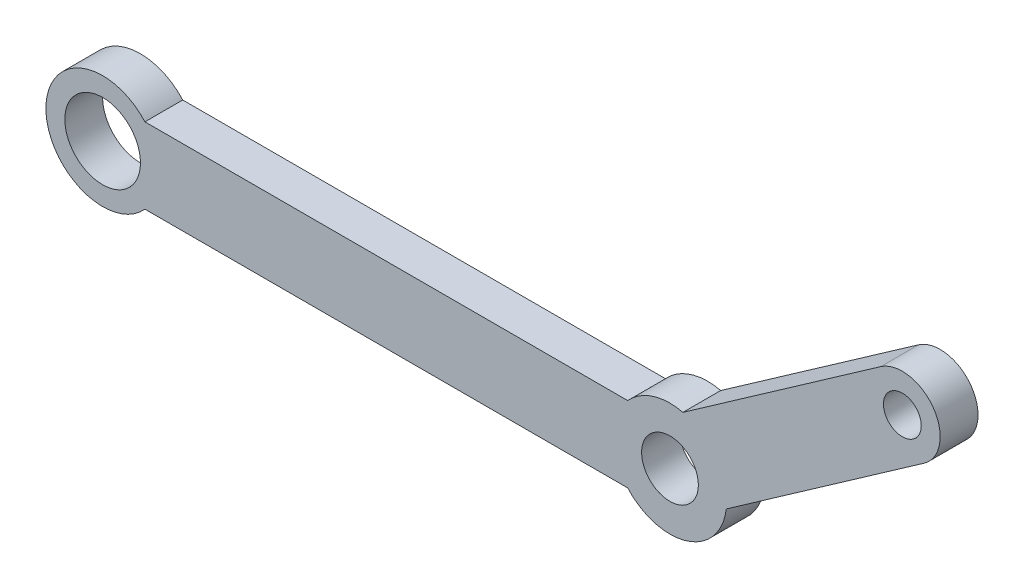
ISO-10303-21;
HEADER;
FILE_DESCRIPTION(('STEP AP214'),'2;1');
FILE_NAME('part.step','',(''),(''),'','','');
FILE_SCHEMA(('AUTOMOTIVE_DESIGN { 1 0 10303 214 1 1 1 1 }'));
ENDSEC;
DATA;
#1=APPLICATION_CONTEXT('core data for automotive mechanical design processes');
#2=APPLICATION_PROTOCOL_DEFINITION('international standard','automotive_design',2000,#1);
#3=PRODUCT_CONTEXT('',#1,'mechanical');
#4=PRODUCT('Part','Part','',(#3));
#5=PRODUCT_RELATED_PRODUCT_CATEGORY('part','',(#4));
#6=PRODUCT_DEFINITION_FORMATION('','',#4);
#7=PRODUCT_DEFINITION_CONTEXT('part definition',#1,'design');
#8=PRODUCT_DEFINITION('design','',#6,#7);
#9=PRODUCT_DEFINITION_SHAPE('','',#8);
#10=(LENGTH_UNIT() NAMED_UNIT(*) SI_UNIT(.MILLI.,.METRE.));
#11=(NAMED_UNIT(*) PLANE_ANGLE_UNIT() SI_UNIT($,.RADIAN.));
#12=(NAMED_UNIT(*) SI_UNIT($,.STERADIAN.) SOLID_ANGLE_UNIT());
#13=UNCERTAINTY_MEASURE_WITH_UNIT(LENGTH_MEASURE(1.E-05),#10,'distance_accuracy_value','');
#14=(GEOMETRIC_REPRESENTATION_CONTEXT(3) GLOBAL_UNCERTAINTY_ASSIGNED_CONTEXT((#13)) GLOBAL_UNIT_ASSIGNED_CONTEXT((#10,
#11,#12)) REPRESENTATION_CONTEXT('',''));
#15=CARTESIAN_POINT('',(0.,0.,0.));
#16=DIRECTION('',(0.,0.,1.));
#17=DIRECTION('',(1.,0.,0.));
#18=AXIS2_PLACEMENT_3D('',#15,#16,#17);
#19=CARTESIAN_POINT('',(30.,0.,2.));
#20=DIRECTION('',(0.,0.,-1.));
#21=DIRECTION('',(-1.,0.,0.));
#22=AXIS2_PLACEMENT_3D('',#19,#20,#21);
#23=CYLINDRICAL_SURFACE('',#22,3.);
#24=CARTESIAN_POINT('',(30.,0.,0.));
#25=DIRECTION('',(0.,0.,1.));
#26=DIRECTION('',(1.,0.,0.));
#27=AXIS2_PLACEMENT_3D('',#24,#25,#26);
#28=CIRCLE('',#27,3.);
#29=CARTESIAN_POINT('',(27.7639320225002,-2.,0.));
#30=VERTEX_POINT('',#29);
#31=CARTESIAN_POINT('',(32.9788325276402,-0.355748186604979,0.));
#32=VERTEX_POINT('',#31);
#33=EDGE_CURVE('E130',#30,#32,#28,.T.);
#34=ORIENTED_EDGE('',*,*,#33,.T.);
#35=DIRECTION('',(0.,0.,-1.));
#36=VECTOR('',#35,1.);
#37=CARTESIAN_POINT('',(32.9788325276402,-0.355748186604979,2.));
#38=LINE('',#37,#36);
#39=CARTESIAN_POINT('',(32.9788325276402,-0.355748186604979,2.));
#40=VERTEX_POINT('',#39);
#41=EDGE_CURVE('E11',#40,#32,#38,.T.);
#42=ORIENTED_EDGE('',*,*,#41,.F.);
#43=CARTESIAN_POINT('',(30.,0.,2.));
#44=DIRECTION('',(0.,0.,1.));
#45=DIRECTION('',(1.,0.,0.));
#46=AXIS2_PLACEMENT_3D('',#43,#44,#45);
#47=CIRCLE('',#46,3.);
#48=CARTESIAN_POINT('',(27.7639320225002,-2.,2.));
#49=VERTEX_POINT('',#48);
#50=EDGE_CURVE('E145',#49,#40,#47,.T.);
#51=ORIENTED_EDGE('',*,*,#50,.F.);
#52=DIRECTION('',(0.,0.,-1.));
#53=VECTOR('',#52,1.);
#54=CARTESIAN_POINT('',(27.7639320225002,-2.,2.));
#55=LINE('',#54,#53);
#56=EDGE_CURVE('E126',#49,#30,#55,.T.);
#57=ORIENTED_EDGE('',*,*,#56,.T.);
#58=EDGE_LOOP('',(#34,#42,#51,#57));
#59=FACE_BOUND('',#58,.T.);
#60=ADVANCED_FACE('F34',(#59),#23,.T.);
#61=CARTESIAN_POINT('',(43.434433537037,6.96534245668763,2.));
#62=DIRECTION('',(-0.573576436351042,0.819152044288995,0.));
#63=DIRECTION('',(-0.819152044288995,-0.573576436351042,0.));
#64=AXIS2_PLACEMENT_3D('',#61,#62,#63);
#65=PLANE('',#64);
#66=DIRECTION('',(0.819152044288995,0.573576436351042,0.));
#67=VECTOR('',#66,1.);
#68=CARTESIAN_POINT('',(43.434433537037,6.96534245668763,0.));
#69=LINE('',#68,#67);
#70=CARTESIAN_POINT('',(43.434433537037,6.96534245668763,0.));
#71=VERTEX_POINT('',#70);
#72=EDGE_CURVE('E133',#32,#71,#69,.T.);
#73=ORIENTED_EDGE('',*,*,#72,.T.);
#74=DIRECTION('',(0.,0.,-1.));
#75=VECTOR('',#74,1.);
#76=CARTESIAN_POINT('',(43.434433537037,6.96534245668763,2.));
#77=LINE('',#76,#75);
#78=CARTESIAN_POINT('',(43.434433537037,6.96534245668763,2.));
#79=VERTEX_POINT('',#78);
#80=EDGE_CURVE('E42',#79,#71,#77,.T.);
#81=ORIENTED_EDGE('',*,*,#80,.F.);
#82=DIRECTION('',(0.819152044288995,0.573576436351042,0.));
#83=VECTOR('',#82,1.);
#84=CARTESIAN_POINT('',(43.434433537037,6.96534245668763,2.));
#85=LINE('',#84,#83);
#86=EDGE_CURVE('E93',#40,#79,#85,.T.);
#87=ORIENTED_EDGE('',*,*,#86,.F.);
#88=ORIENTED_EDGE('',*,*,#41,.T.);
#89=EDGE_LOOP('',(#73,#81,#87,#88));
#90=FACE_BOUND('',#89,.T.);
#91=ADVANCED_FACE('F226',(#90),#65,.F.);
#92=CARTESIAN_POINT('',(42.2872806643349,8.60364654526562,2.));
#93=DIRECTION('',(0.,0.,-1.));
#94=DIRECTION('',(-1.,0.,0.));
#95=AXIS2_PLACEMENT_3D('',#92,#93,#94);
#96=CYLINDRICAL_SURFACE('',#95,2.);
#97=CARTESIAN_POINT('',(42.2872806643349,8.60364654526562,0.));
#98=DIRECTION('',(0.,0.,1.));
#99=DIRECTION('',(1.,0.,0.));
#100=AXIS2_PLACEMENT_3D('',#97,#98,#99);
#101=CIRCLE('',#100,2.);
#102=CARTESIAN_POINT('',(41.1401277916328,10.2419506338436,0.));
#103=VERTEX_POINT('',#102);
#104=EDGE_CURVE('E136',#71,#103,#101,.T.);
#105=ORIENTED_EDGE('',*,*,#104,.T.);
#106=DIRECTION('',(0.,0.,-1.));
#107=VECTOR('',#106,1.);
#108=CARTESIAN_POINT('',(41.1401277916328,10.2419506338436,2.));
#109=LINE('',#108,#107);
#110=CARTESIAN_POINT('',(41.1401277916328,10.2419506338436,2.));
#111=VERTEX_POINT('',#110);
#112=EDGE_CURVE('E152',#111,#103,#109,.T.);
#113=ORIENTED_EDGE('',*,*,#112,.F.);
#114=CARTESIAN_POINT('',(42.2872806643349,8.60364654526562,2.));
#115=DIRECTION('',(0.,0.,1.));
#116=DIRECTION('',(1.,0.,0.));
#117=AXIS2_PLACEMENT_3D('',#114,#115,#116);
#118=CIRCLE('',#117,2.);
#119=EDGE_CURVE('E160',#79,#111,#118,.T.);
#120=ORIENTED_EDGE('',*,*,#119,.F.);
#121=ORIENTED_EDGE('',*,*,#80,.T.);
#122=EDGE_LOOP('',(#105,#113,#120,#121));
#123=FACE_BOUND('',#122,.T.);
#124=ADVANCED_FACE('F158',(#123),#96,.T.);
#125=CARTESIAN_POINT('',(41.1401277916328,10.2419506338436,2.));
#126=DIRECTION('',(0.573576436351041,-0.819152044288995,0.));
#127=DIRECTION('',(0.819152044288995,0.573576436351041,0.));
#128=AXIS2_PLACEMENT_3D('',#125,#126,#127);
#129=PLANE('',#128);
#130=DIRECTION('',(-0.819152044288995,-0.573576436351041,0.));
#131=VECTOR('',#130,1.);
#132=CARTESIAN_POINT('',(41.1401277916328,10.2419506338436,0.));
#133=LINE('',#132,#131);
#134=CARTESIAN_POINT('',(30.684526782236,2.920859990551,0.));
#135=VERTEX_POINT('',#134);
#136=EDGE_CURVE('E138',#103,#135,#133,.T.);
#137=ORIENTED_EDGE('',*,*,#136,.T.);
#138=DIRECTION('',(0.,0.,-1.));
#139=VECTOR('',#138,1.);
#140=CARTESIAN_POINT('',(30.684526782236,2.920859990551,2.));
#141=LINE('',#140,#139);
#142=CARTESIAN_POINT('',(30.684526782236,2.920859990551,2.));
#143=VERTEX_POINT('',#142);
#144=EDGE_CURVE('E149',#143,#135,#141,.T.);
#145=ORIENTED_EDGE('',*,*,#144,.F.);
#146=DIRECTION('',(-0.819152044288995,-0.573576436351041,0.));
#147=VECTOR('',#146,1.);
#148=CARTESIAN_POINT('',(41.1401277916328,10.2419506338436,2.));
#149=LINE('',#148,#147);
#150=EDGE_CURVE('E172',#111,#143,#149,.T.);
#151=ORIENTED_EDGE('',*,*,#150,.F.);
#152=ORIENTED_EDGE('',*,*,#112,.T.);
#153=EDGE_LOOP('',(#137,#145,#151,#152));
#154=FACE_BOUND('',#153,.T.);
#155=ADVANCED_FACE('F168',(#154),#129,.F.);
#156=CARTESIAN_POINT('',(30.,0.,2.));
#157=DIRECTION('',(0.,0.,-1.));
#158=DIRECTION('',(-1.,0.,0.));
#159=AXIS2_PLACEMENT_3D('',#156,#157,#158);
#160=CYLINDRICAL_SURFACE('',#159,3.);
#161=CARTESIAN_POINT('',(30.,0.,0.));
#162=DIRECTION('',(0.,0.,1.));
#163=DIRECTION('',(1.,0.,0.));
#164=AXIS2_PLACEMENT_3D('',#161,#162,#163);
#165=CIRCLE('',#164,3.);
#166=CARTESIAN_POINT('',(27.7639320225002,2.,0.));
#167=VERTEX_POINT('',#166);
#168=EDGE_CURVE('E140',#135,#167,#165,.T.);
#169=ORIENTED_EDGE('',*,*,#168,.T.);
#170=DIRECTION('',(0.,0.,-1.));
#171=VECTOR('',#170,1.);
#172=CARTESIAN_POINT('',(27.7639320225002,2.,2.));
#173=LINE('',#172,#171);
#174=CARTESIAN_POINT('',(27.7639320225002,2.,2.));
#175=VERTEX_POINT('',#174);
#176=EDGE_CURVE('E121',#175,#167,#173,.T.);
#177=ORIENTED_EDGE('',*,*,#176,.F.);
#178=CARTESIAN_POINT('',(30.,0.,2.));
#179=DIRECTION('',(0.,0.,1.));
#180=DIRECTION('',(1.,0.,0.));
#181=AXIS2_PLACEMENT_3D('',#178,#179,#180);
#182=CIRCLE('',#181,3.);
#183=EDGE_CURVE('E112',#143,#175,#182,.T.);
#184=ORIENTED_EDGE('',*,*,#183,.F.);
#185=ORIENTED_EDGE('',*,*,#144,.T.);
#186=EDGE_LOOP('',(#169,#177,#184,#185));
#187=FACE_BOUND('',#186,.T.);
#188=ADVANCED_FACE('F171',(#187),#160,.T.);
#189=CARTESIAN_POINT('',(2.23606797749979,2.,2.));
#190=DIRECTION('',(0.,-1.,0.));
#191=DIRECTION('',(0.,0.,-1.));
#192=AXIS2_PLACEMENT_3D('',#189,#190,#191);
#193=PLANE('',#192);
#194=DIRECTION('',(-1.,0.,0.));
#195=VECTOR('',#194,1.);
#196=CARTESIAN_POINT('',(2.23606797749979,2.,0.));
#197=LINE('',#196,#195);
#198=CARTESIAN_POINT('',(2.23606797749979,2.,0.));
#199=VERTEX_POINT('',#198);
#200=EDGE_CURVE('E120',#167,#199,#197,.T.);
#201=ORIENTED_EDGE('',*,*,#200,.T.);
#202=DIRECTION('',(0.,0.,-1.));
#203=VECTOR('',#202,1.);
#204=CARTESIAN_POINT('',(2.23606797749979,2.,2.));
#205=LINE('',#204,#203);
#206=CARTESIAN_POINT('',(2.23606797749979,2.,2.));
#207=VERTEX_POINT('',#206);
#208=EDGE_CURVE('E117',#207,#199,#205,.T.);
#209=ORIENTED_EDGE('',*,*,#208,.F.);
#210=DIRECTION('',(-1.,0.,0.));
#211=VECTOR('',#210,1.);
#212=CARTESIAN_POINT('',(2.23606797749979,2.,2.));
#213=LINE('',#212,#211);
#214=EDGE_CURVE('E106',#175,#207,#213,.T.);
#215=ORIENTED_EDGE('',*,*,#214,.F.);
#216=ORIENTED_EDGE('',*,*,#176,.T.);
#217=EDGE_LOOP('',(#201,#209,#215,#216));
#218=FACE_BOUND('',#217,.T.);
#219=ADVANCED_FACE('F118',(#218),#193,.F.);
#220=CARTESIAN_POINT('',(0.,0.,2.));
#221=DIRECTION('',(0.,0.,-1.));
#222=DIRECTION('',(-1.,0.,0.));
#223=AXIS2_PLACEMENT_3D('',#220,#221,#222);
#224=CYLINDRICAL_SURFACE('',#223,3.);
#225=CARTESIAN_POINT('',(0.,0.,0.));
#226=DIRECTION('',(0.,0.,1.));
#227=DIRECTION('',(1.,0.,0.));
#228=AXIS2_PLACEMENT_3D('',#225,#226,#227);
#229=CIRCLE('',#228,3.);
#230=CARTESIAN_POINT('',(2.23606797749979,-2.,0.));
#231=VERTEX_POINT('',#230);
#232=EDGE_CURVE('E79',#199,#231,#229,.T.);
#233=ORIENTED_EDGE('',*,*,#232,.T.);
#234=DIRECTION('',(0.,0.,-1.));
#235=VECTOR('',#234,1.);
#236=CARTESIAN_POINT('',(2.23606797749979,-2.,2.));
#237=LINE('',#236,#235);
#238=CARTESIAN_POINT('',(2.23606797749979,-2.,2.));
#239=VERTEX_POINT('',#238);
#240=EDGE_CURVE('E122',#239,#231,#237,.T.);
#241=ORIENTED_EDGE('',*,*,#240,.F.);
#242=CARTESIAN_POINT('',(0.,0.,2.));
#243=DIRECTION('',(0.,0.,1.));
#244=DIRECTION('',(1.,0.,0.));
#245=AXIS2_PLACEMENT_3D('',#242,#243,#244);
#246=CIRCLE('',#245,3.);
#247=EDGE_CURVE('E110',#207,#239,#246,.T.);
#248=ORIENTED_EDGE('',*,*,#247,.F.);
#249=ORIENTED_EDGE('',*,*,#208,.T.);
#250=EDGE_LOOP('',(#233,#241,#248,#249));
#251=FACE_BOUND('',#250,.T.);
#252=ADVANCED_FACE('F124',(#251),#224,.T.);
#253=CARTESIAN_POINT('',(2.23606797749979,-2.,2.));
#254=DIRECTION('',(0.,1.,0.));
#255=DIRECTION('',(0.,0.,1.));
#256=AXIS2_PLACEMENT_3D('',#253,#254,#255);
#257=PLANE('',#256);
#258=DIRECTION('',(1.,0.,0.));
#259=VECTOR('',#258,1.);
#260=CARTESIAN_POINT('',(2.23606797749979,-2.,0.));
#261=LINE('',#260,#259);
#262=EDGE_CURVE('E85',#231,#30,#261,.T.);
#263=ORIENTED_EDGE('',*,*,#262,.T.);
#264=ORIENTED_EDGE('',*,*,#56,.F.);
#265=DIRECTION('',(1.,0.,0.));
#266=VECTOR('',#265,1.);
#267=CARTESIAN_POINT('',(2.23606797749979,-2.,2.));
#268=LINE('',#267,#266);
#269=EDGE_CURVE('E50',#239,#49,#268,.T.);
#270=ORIENTED_EDGE('',*,*,#269,.F.);
#271=ORIENTED_EDGE('',*,*,#240,.T.);
#272=EDGE_LOOP('',(#263,#264,#270,#271));
#273=FACE_BOUND('',#272,.T.);
#274=ADVANCED_FACE('F207',(#273),#257,.F.);
#275=CARTESIAN_POINT('',(30.,0.,2.));
#276=DIRECTION('',(0.,0.,1.));
#277=DIRECTION('',(1.,0.,0.));
#278=AXIS2_PLACEMENT_3D('',#275,#276,#277);
#279=PLANE('',#278);
#280=CARTESIAN_POINT('',(30.,0.,2.));
#281=DIRECTION('',(0.,0.,1.));
#282=DIRECTION('',(1.,0.,0.));
#283=AXIS2_PLACEMENT_3D('',#280,#281,#282);
#284=CIRCLE('',#283,1.5);
#285=CARTESIAN_POINT('',(31.5,0.,2.));
#286=VERTEX_POINT('',#285);
#287=EDGE_CURVE('E190',#286,#286,#284,.T.);
#288=ORIENTED_EDGE('',*,*,#287,.F.);
#289=EDGE_LOOP('',(#288));
#290=FACE_BOUND('',#289,.T.);
#291=CARTESIAN_POINT('',(42.2872806643349,8.60364654526562,2.));
#292=DIRECTION('',(0.,0.,1.));
#293=DIRECTION('',(1.,0.,0.));
#294=AXIS2_PLACEMENT_3D('',#291,#292,#293);
#295=CIRCLE('',#294,0.999999999999998);
#296=CARTESIAN_POINT('',(43.2872806643349,8.60364654526562,2.));
#297=VERTEX_POINT('',#296);
#298=EDGE_CURVE('E184',#297,#297,#295,.T.);
#299=ORIENTED_EDGE('',*,*,#298,.F.);
#300=EDGE_LOOP('',(#299));
#301=FACE_BOUND('',#300,.T.);
#302=CARTESIAN_POINT('',(0.,0.,2.));
#303=DIRECTION('',(0.,0.,1.));
#304=DIRECTION('',(1.,0.,0.));
#305=AXIS2_PLACEMENT_3D('',#302,#303,#304);
#306=CIRCLE('',#305,2.);
#307=CARTESIAN_POINT('',(2.,0.,2.));
#308=VERTEX_POINT('',#307);
#309=EDGE_CURVE('E178',#308,#308,#306,.T.);
#310=ORIENTED_EDGE('',*,*,#309,.F.);
#311=EDGE_LOOP('',(#310));
#312=FACE_BOUND('',#311,.T.);
#313=ORIENTED_EDGE('',*,*,#50,.T.);
#314=ORIENTED_EDGE('',*,*,#86,.T.);
#315=ORIENTED_EDGE('',*,*,#119,.T.);
#316=ORIENTED_EDGE('',*,*,#150,.T.);
#317=ORIENTED_EDGE('',*,*,#183,.T.);
#318=ORIENTED_EDGE('',*,*,#214,.T.);
#319=ORIENTED_EDGE('',*,*,#247,.T.);
#320=ORIENTED_EDGE('',*,*,#269,.T.);
#321=EDGE_LOOP('',(#313,#314,#315,#316,#317,#318,#319,#320));
#322=FACE_BOUND('',#321,.T.);
#323=ADVANCED_FACE('F108',(#290,#301,#312,#322),#279,.T.);
#324=CARTESIAN_POINT('',(30.,0.,0.));
#325=DIRECTION('',(0.,0.,1.));
#326=DIRECTION('',(1.,0.,0.));
#327=AXIS2_PLACEMENT_3D('',#324,#325,#326);
#328=PLANE('',#327);
#329=CARTESIAN_POINT('',(30.,0.,0.));
#330=DIRECTION('',(0.,0.,1.));
#331=DIRECTION('',(1.,0.,0.));
#332=AXIS2_PLACEMENT_3D('',#329,#330,#331);
#333=CIRCLE('',#332,1.5);
#334=CARTESIAN_POINT('',(31.5,0.,0.));
#335=VERTEX_POINT('',#334);
#336=EDGE_CURVE('E181',#335,#335,#333,.T.);
#337=ORIENTED_EDGE('',*,*,#336,.T.);
#338=EDGE_LOOP('',(#337));
#339=FACE_BOUND('',#338,.T.);
#340=CARTESIAN_POINT('',(42.2872806643349,8.60364654526562,0.));
#341=DIRECTION('',(0.,0.,1.));
#342=DIRECTION('',(1.,0.,0.));
#343=AXIS2_PLACEMENT_3D('',#340,#341,#342);
#344=CIRCLE('',#343,0.999999999999998);
#345=CARTESIAN_POINT('',(43.2872806643349,8.60364654526562,0.));
#346=VERTEX_POINT('',#345);
#347=EDGE_CURVE('E187',#346,#346,#344,.T.);
#348=ORIENTED_EDGE('',*,*,#347,.T.);
#349=EDGE_LOOP('',(#348));
#350=FACE_BOUND('',#349,.T.);
#351=CARTESIAN_POINT('',(0.,0.,0.));
#352=DIRECTION('',(0.,0.,1.));
#353=DIRECTION('',(1.,0.,0.));
#354=AXIS2_PLACEMENT_3D('',#351,#352,#353);
#355=CIRCLE('',#354,2.);
#356=CARTESIAN_POINT('',(2.,0.,0.));
#357=VERTEX_POINT('',#356);
#358=EDGE_CURVE('E134',#357,#357,#355,.T.);
#359=ORIENTED_EDGE('',*,*,#358,.T.);
#360=EDGE_LOOP('',(#359));
#361=FACE_BOUND('',#360,.T.);
#362=ORIENTED_EDGE('',*,*,#33,.F.);
#363=ORIENTED_EDGE('',*,*,#262,.F.);
#364=ORIENTED_EDGE('',*,*,#232,.F.);
#365=ORIENTED_EDGE('',*,*,#200,.F.);
#366=ORIENTED_EDGE('',*,*,#168,.F.);
#367=ORIENTED_EDGE('',*,*,#136,.F.);
#368=ORIENTED_EDGE('',*,*,#104,.F.);
#369=ORIENTED_EDGE('',*,*,#72,.F.);
#370=EDGE_LOOP('',(#362,#363,#364,#365,#366,#367,#368,#369));
#371=FACE_BOUND('',#370,.T.);
#372=ADVANCED_FACE('F164',(#339,#350,#361,#371),#328,.F.);
#373=CARTESIAN_POINT('',(0.,0.,0.));
#374=DIRECTION('',(0.,0.,1.));
#375=DIRECTION('',(1.,0.,0.));
#376=AXIS2_PLACEMENT_3D('',#373,#374,#375);
#377=CYLINDRICAL_SURFACE('',#376,2.);
#378=ORIENTED_EDGE('',*,*,#358,.F.);
#379=EDGE_LOOP('',(#378));
#380=FACE_BOUND('',#379,.T.);
#381=ORIENTED_EDGE('',*,*,#309,.T.);
#382=EDGE_LOOP('',(#381));
#383=FACE_BOUND('',#382,.T.);
#384=ADVANCED_FACE('F213',(#380,#383),#377,.F.);
#385=CARTESIAN_POINT('',(42.2872806643349,8.60364654526562,0.));
#386=DIRECTION('',(0.,0.,1.));
#387=DIRECTION('',(1.,0.,0.));
#388=AXIS2_PLACEMENT_3D('',#385,#386,#387);
#389=CYLINDRICAL_SURFACE('',#388,0.999999999999998);
#390=ORIENTED_EDGE('',*,*,#347,.F.);
#391=EDGE_LOOP('',(#390));
#392=FACE_BOUND('',#391,.T.);
#393=ORIENTED_EDGE('',*,*,#298,.T.);
#394=EDGE_LOOP('',(#393));
#395=FACE_BOUND('',#394,.T.);
#396=ADVANCED_FACE('F201',(#392,#395),#389,.F.);
#397=CARTESIAN_POINT('',(30.,0.,0.));
#398=DIRECTION('',(0.,0.,1.));
#399=DIRECTION('',(1.,0.,0.));
#400=AXIS2_PLACEMENT_3D('',#397,#398,#399);
#401=CYLINDRICAL_SURFACE('',#400,1.5);
#402=ORIENTED_EDGE('',*,*,#336,.F.);
#403=EDGE_LOOP('',(#402));
#404=FACE_BOUND('',#403,.T.);
#405=ORIENTED_EDGE('',*,*,#287,.T.);
#406=EDGE_LOOP('',(#405));
#407=FACE_BOUND('',#406,.T.);
#408=ADVANCED_FACE('F198',(#404,#407),#401,.F.);
#409=CLOSED_SHELL('',(#60,#91,#124,#155,#188,#219,#252,#274,#323,#372,#384,#396,#408));
#410=MANIFOLD_SOLID_BREP('B2',#409);
#411=ADVANCED_BREP_SHAPE_REPRESENTATION('',(#18,#410),#14);
#412=SHAPE_DEFINITION_REPRESENTATION(#9,#411);
ENDSEC;
END-ISO-10303-21;
